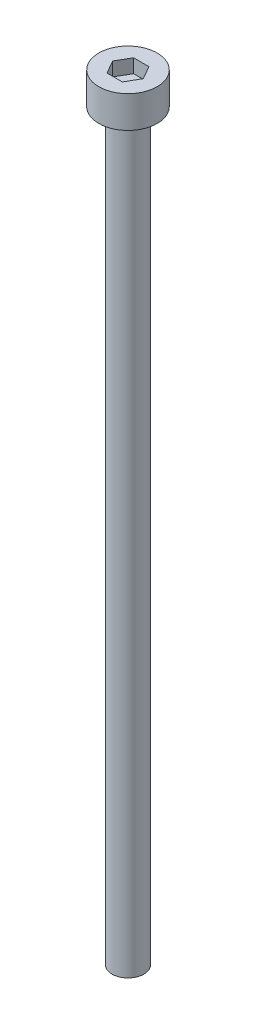
ISO-10303-21;
HEADER;
FILE_DESCRIPTION(('STEP AP214'),'2;1');
FILE_NAME('part.step','',(''),(''),'','','');
FILE_SCHEMA(('AUTOMOTIVE_DESIGN { 1 0 10303 214 1 1 1 1 }'));
ENDSEC;
DATA;
#1=APPLICATION_CONTEXT('core data for automotive mechanical design processes');
#2=APPLICATION_PROTOCOL_DEFINITION('international standard','automotive_design',2000,#1);
#3=PRODUCT_CONTEXT('',#1,'mechanical');
#4=PRODUCT('Part','Part','',(#3));
#5=PRODUCT_RELATED_PRODUCT_CATEGORY('part','',(#4));
#6=PRODUCT_DEFINITION_FORMATION('','',#4);
#7=PRODUCT_DEFINITION_CONTEXT('part definition',#1,'design');
#8=PRODUCT_DEFINITION('design','',#6,#7);
#9=PRODUCT_DEFINITION_SHAPE('','',#8);
#10=(LENGTH_UNIT() NAMED_UNIT(*) SI_UNIT(.MILLI.,.METRE.));
#11=(NAMED_UNIT(*) PLANE_ANGLE_UNIT() SI_UNIT($,.RADIAN.));
#12=(NAMED_UNIT(*) SI_UNIT($,.STERADIAN.) SOLID_ANGLE_UNIT());
#13=UNCERTAINTY_MEASURE_WITH_UNIT(LENGTH_MEASURE(1.E-05),#10,'distance_accuracy_value','');
#14=(GEOMETRIC_REPRESENTATION_CONTEXT(3) GLOBAL_UNCERTAINTY_ASSIGNED_CONTEXT((#13)) GLOBAL_UNIT_ASSIGNED_CONTEXT((#10,
#11,#12)) REPRESENTATION_CONTEXT('',''));
#15=CARTESIAN_POINT('',(0.,0.,0.));
#16=DIRECTION('',(0.,0.,1.));
#17=DIRECTION('',(1.,0.,0.));
#18=AXIS2_PLACEMENT_3D('',#15,#16,#17);
#19=CARTESIAN_POINT('',(0.,3.,0.));
#20=DIRECTION('',(0.,-1.,0.));
#21=DIRECTION('',(0.,0.,-1.));
#22=AXIS2_PLACEMENT_3D('',#19,#20,#21);
#23=CYLINDRICAL_SURFACE('',#22,2.75);
#24=CARTESIAN_POINT('',(0.,3.,0.));
#25=DIRECTION('',(0.,1.,0.));
#26=DIRECTION('',(0.,0.,1.));
#27=AXIS2_PLACEMENT_3D('',#24,#25,#26);
#28=CIRCLE('',#27,2.75);
#29=CARTESIAN_POINT('',(0.,3.,2.75));
#30=VERTEX_POINT('',#29);
#31=EDGE_CURVE('E45',#30,#30,#28,.T.);
#32=ORIENTED_EDGE('',*,*,#31,.F.);
#33=EDGE_LOOP('',(#32));
#34=FACE_BOUND('',#33,.T.);
#35=CARTESIAN_POINT('',(0.,0.,0.));
#36=DIRECTION('',(0.,1.,0.));
#37=DIRECTION('',(0.,0.,1.));
#38=AXIS2_PLACEMENT_3D('',#35,#36,#37);
#39=CIRCLE('',#38,2.75);
#40=CARTESIAN_POINT('',(0.,0.,2.75));
#41=VERTEX_POINT('',#40);
#42=EDGE_CURVE('E40',#41,#41,#39,.T.);
#43=ORIENTED_EDGE('',*,*,#42,.T.);
#44=EDGE_LOOP('',(#43));
#45=FACE_BOUND('',#44,.T.);
#46=ADVANCED_FACE('F37',(#34,#45),#23,.T.);
#47=CARTESIAN_POINT('',(0.,3.,0.));
#48=DIRECTION('',(0.,1.,0.));
#49=DIRECTION('',(0.,0.,1.));
#50=AXIS2_PLACEMENT_3D('',#47,#48,#49);
#51=PLANE('',#50);
#52=DIRECTION('',(0.5,0.,-0.866025403784439));
#53=VECTOR('',#52,1.);
#54=CARTESIAN_POINT('',(0.721687836487032,3.,1.25));
#55=LINE('',#54,#53);
#56=CARTESIAN_POINT('',(0.721687836487032,3.,1.25));
#57=VERTEX_POINT('',#56);
#58=CARTESIAN_POINT('',(1.44337567297406,3.,0.));
#59=VERTEX_POINT('',#58);
#60=EDGE_CURVE('E53',#57,#59,#55,.T.);
#61=ORIENTED_EDGE('',*,*,#60,.F.);
#62=DIRECTION('',(1.,0.,0.));
#63=VECTOR('',#62,1.);
#64=CARTESIAN_POINT('',(-0.721687836487033,3.,1.25));
#65=LINE('',#64,#63);
#66=CARTESIAN_POINT('',(-0.721687836487033,3.,1.25));
#67=VERTEX_POINT('',#66);
#68=EDGE_CURVE('E137',#67,#57,#65,.T.);
#69=ORIENTED_EDGE('',*,*,#68,.F.);
#70=DIRECTION('',(0.5,0.,0.866025403784439));
#71=VECTOR('',#70,1.);
#72=CARTESIAN_POINT('',(-1.44337567297407,3.,0.));
#73=LINE('',#72,#71);
#74=CARTESIAN_POINT('',(-1.44337567297407,3.,0.));
#75=VERTEX_POINT('',#74);
#76=EDGE_CURVE('E135',#75,#67,#73,.T.);
#77=ORIENTED_EDGE('',*,*,#76,.F.);
#78=DIRECTION('',(-0.5,0.,0.866025403784438));
#79=VECTOR('',#78,1.);
#80=CARTESIAN_POINT('',(-0.721687836487033,3.,-1.25));
#81=LINE('',#80,#79);
#82=CARTESIAN_POINT('',(-0.721687836487033,3.,-1.25));
#83=VERTEX_POINT('',#82);
#84=EDGE_CURVE('E101',#83,#75,#81,.T.);
#85=ORIENTED_EDGE('',*,*,#84,.F.);
#86=DIRECTION('',(-1.,0.,0.));
#87=VECTOR('',#86,1.);
#88=CARTESIAN_POINT('',(0.721687836487032,3.,-1.25));
#89=LINE('',#88,#87);
#90=CARTESIAN_POINT('',(0.721687836487032,3.,-1.25));
#91=VERTEX_POINT('',#90);
#92=EDGE_CURVE('E131',#91,#83,#89,.T.);
#93=ORIENTED_EDGE('',*,*,#92,.F.);
#94=DIRECTION('',(-0.5,0.,-0.866025403784439));
#95=VECTOR('',#94,1.);
#96=CARTESIAN_POINT('',(1.44337567297406,3.,0.));
#97=LINE('',#96,#95);
#98=EDGE_CURVE('E127',#59,#91,#97,.T.);
#99=ORIENTED_EDGE('',*,*,#98,.F.);
#100=EDGE_LOOP('',(#61,#69,#77,#85,#93,#99));
#101=FACE_BOUND('',#100,.T.);
#102=ORIENTED_EDGE('',*,*,#31,.T.);
#103=EDGE_LOOP('',(#102));
#104=FACE_BOUND('',#103,.T.);
#105=ADVANCED_FACE('F155',(#101,#104),#51,.T.);
#106=CARTESIAN_POINT('',(0.,0.,0.));
#107=DIRECTION('',(0.,1.,0.));
#108=DIRECTION('',(0.,0.,1.));
#109=AXIS2_PLACEMENT_3D('',#106,#107,#108);
#110=PLANE('',#109);
#111=CARTESIAN_POINT('',(0.,0.,0.));
#112=DIRECTION('',(0.,-1.,0.));
#113=DIRECTION('',(0.,0.,-1.));
#114=AXIS2_PLACEMENT_3D('',#111,#112,#113);
#115=CIRCLE('',#114,1.5);
#116=CARTESIAN_POINT('',(0.,0.,-1.5));
#117=VERTEX_POINT('',#116);
#118=EDGE_CURVE('E11',#117,#117,#115,.T.);
#119=ORIENTED_EDGE('',*,*,#118,.F.);
#120=EDGE_LOOP('',(#119));
#121=FACE_BOUND('',#120,.T.);
#122=ORIENTED_EDGE('',*,*,#42,.F.);
#123=EDGE_LOOP('',(#122));
#124=FACE_BOUND('',#123,.T.);
#125=ADVANCED_FACE('F152',(#121,#124),#110,.F.);
#126=CARTESIAN_POINT('',(0.721687836487032,1.7,1.25));
#127=DIRECTION('',(0.866025403784439,0.,0.5));
#128=DIRECTION('',(0.5,0.,-0.866025403784439));
#129=AXIS2_PLACEMENT_3D('',#126,#127,#128);
#130=PLANE('',#129);
#131=ORIENTED_EDGE('',*,*,#60,.T.);
#132=DIRECTION('',(0.,1.,0.));
#133=VECTOR('',#132,1.);
#134=CARTESIAN_POINT('',(1.44337567297406,1.7,0.));
#135=LINE('',#134,#133);
#136=CARTESIAN_POINT('',(1.44337567297406,1.7,0.));
#137=VERTEX_POINT('',#136);
#138=EDGE_CURVE('E83',#137,#59,#135,.T.);
#139=ORIENTED_EDGE('',*,*,#138,.F.);
#140=DIRECTION('',(0.5,0.,-0.866025403784439));
#141=VECTOR('',#140,1.);
#142=CARTESIAN_POINT('',(0.721687836487032,1.7,1.25));
#143=LINE('',#142,#141);
#144=CARTESIAN_POINT('',(0.721687836487032,1.7,1.25));
#145=VERTEX_POINT('',#144);
#146=EDGE_CURVE('E139',#145,#137,#143,.T.);
#147=ORIENTED_EDGE('',*,*,#146,.F.);
#148=DIRECTION('',(0.,1.,0.));
#149=VECTOR('',#148,1.);
#150=CARTESIAN_POINT('',(0.721687836487032,1.7,1.25));
#151=LINE('',#150,#149);
#152=EDGE_CURVE('E61',#145,#57,#151,.T.);
#153=ORIENTED_EDGE('',*,*,#152,.T.);
#154=EDGE_LOOP('',(#131,#139,#147,#153));
#155=FACE_BOUND('',#154,.T.);
#156=ADVANCED_FACE('F154',(#155),#130,.F.);
#157=CARTESIAN_POINT('',(-0.721687836487033,1.7,1.25));
#158=DIRECTION('',(0.,0.,1.));
#159=DIRECTION('',(1.,0.,0.));
#160=AXIS2_PLACEMENT_3D('',#157,#158,#159);
#161=PLANE('',#160);
#162=ORIENTED_EDGE('',*,*,#68,.T.);
#163=ORIENTED_EDGE('',*,*,#152,.F.);
#164=DIRECTION('',(1.,0.,0.));
#165=VECTOR('',#164,1.);
#166=CARTESIAN_POINT('',(-0.721687836487033,1.7,1.25));
#167=LINE('',#166,#165);
#168=CARTESIAN_POINT('',(-0.721687836487033,1.7,1.25));
#169=VERTEX_POINT('',#168);
#170=EDGE_CURVE('E113',#169,#145,#167,.T.);
#171=ORIENTED_EDGE('',*,*,#170,.F.);
#172=DIRECTION('',(0.,1.,0.));
#173=VECTOR('',#172,1.);
#174=CARTESIAN_POINT('',(-0.721687836487033,1.7,1.25));
#175=LINE('',#174,#173);
#176=EDGE_CURVE('E105',#169,#67,#175,.T.);
#177=ORIENTED_EDGE('',*,*,#176,.T.);
#178=EDGE_LOOP('',(#162,#163,#171,#177));
#179=FACE_BOUND('',#178,.T.);
#180=ADVANCED_FACE('F161',(#179),#161,.F.);
#181=CARTESIAN_POINT('',(-1.44337567297407,1.7,0.));
#182=DIRECTION('',(-0.866025403784439,0.,0.5));
#183=DIRECTION('',(0.5,0.,0.866025403784439));
#184=AXIS2_PLACEMENT_3D('',#181,#182,#183);
#185=PLANE('',#184);
#186=ORIENTED_EDGE('',*,*,#76,.T.);
#187=ORIENTED_EDGE('',*,*,#176,.F.);
#188=DIRECTION('',(0.5,0.,0.866025403784439));
#189=VECTOR('',#188,1.);
#190=CARTESIAN_POINT('',(-1.44337567297407,1.7,0.));
#191=LINE('',#190,#189);
#192=CARTESIAN_POINT('',(-1.44337567297407,1.7,0.));
#193=VERTEX_POINT('',#192);
#194=EDGE_CURVE('E109',#193,#169,#191,.T.);
#195=ORIENTED_EDGE('',*,*,#194,.F.);
#196=DIRECTION('',(0.,1.,0.));
#197=VECTOR('',#196,1.);
#198=CARTESIAN_POINT('',(-1.44337567297407,1.7,0.));
#199=LINE('',#198,#197);
#200=EDGE_CURVE('E94',#193,#75,#199,.T.);
#201=ORIENTED_EDGE('',*,*,#200,.T.);
#202=EDGE_LOOP('',(#186,#187,#195,#201));
#203=FACE_BOUND('',#202,.T.);
#204=ADVANCED_FACE('F110',(#203),#185,.F.);
#205=CARTESIAN_POINT('',(-0.721687836487033,1.7,-1.25));
#206=DIRECTION('',(-0.866025403784439,0.,-0.5));
#207=DIRECTION('',(-0.5,0.,0.866025403784439));
#208=AXIS2_PLACEMENT_3D('',#205,#206,#207);
#209=PLANE('',#208);
#210=ORIENTED_EDGE('',*,*,#84,.T.);
#211=ORIENTED_EDGE('',*,*,#200,.F.);
#212=DIRECTION('',(-0.5,0.,0.866025403784438));
#213=VECTOR('',#212,1.);
#214=CARTESIAN_POINT('',(-0.721687836487033,1.7,-1.25));
#215=LINE('',#214,#213);
#216=CARTESIAN_POINT('',(-0.721687836487033,1.7,-1.25));
#217=VERTEX_POINT('',#216);
#218=EDGE_CURVE('E98',#217,#193,#215,.T.);
#219=ORIENTED_EDGE('',*,*,#218,.F.);
#220=DIRECTION('',(0.,1.,0.));
#221=VECTOR('',#220,1.);
#222=CARTESIAN_POINT('',(-0.721687836487033,1.7,-1.25));
#223=LINE('',#222,#221);
#224=EDGE_CURVE('E106',#217,#83,#223,.T.);
#225=ORIENTED_EDGE('',*,*,#224,.T.);
#226=EDGE_LOOP('',(#210,#211,#219,#225));
#227=FACE_BOUND('',#226,.T.);
#228=ADVANCED_FACE('F96',(#227),#209,.F.);
#229=CARTESIAN_POINT('',(0.721687836487032,1.7,-1.25));
#230=DIRECTION('',(0.,0.,-1.));
#231=DIRECTION('',(-1.,0.,0.));
#232=AXIS2_PLACEMENT_3D('',#229,#230,#231);
#233=PLANE('',#232);
#234=ORIENTED_EDGE('',*,*,#92,.T.);
#235=ORIENTED_EDGE('',*,*,#224,.F.);
#236=DIRECTION('',(-1.,0.,0.));
#237=VECTOR('',#236,1.);
#238=CARTESIAN_POINT('',(0.721687836487032,1.7,-1.25));
#239=LINE('',#238,#237);
#240=CARTESIAN_POINT('',(0.721687836487032,1.7,-1.25));
#241=VERTEX_POINT('',#240);
#242=EDGE_CURVE('E119',#241,#217,#239,.T.);
#243=ORIENTED_EDGE('',*,*,#242,.F.);
#244=DIRECTION('',(0.,1.,0.));
#245=VECTOR('',#244,1.);
#246=CARTESIAN_POINT('',(0.721687836487032,1.7,-1.25));
#247=LINE('',#246,#245);
#248=EDGE_CURVE('E143',#241,#91,#247,.T.);
#249=ORIENTED_EDGE('',*,*,#248,.T.);
#250=EDGE_LOOP('',(#234,#235,#243,#249));
#251=FACE_BOUND('',#250,.T.);
#252=ADVANCED_FACE('F206',(#251),#233,.F.);
#253=CARTESIAN_POINT('',(1.44337567297406,1.7,0.));
#254=DIRECTION('',(0.866025403784439,0.,-0.5));
#255=DIRECTION('',(-0.5,0.,-0.866025403784439));
#256=AXIS2_PLACEMENT_3D('',#253,#254,#255);
#257=PLANE('',#256);
#258=ORIENTED_EDGE('',*,*,#98,.T.);
#259=ORIENTED_EDGE('',*,*,#248,.F.);
#260=DIRECTION('',(-0.5,0.,-0.866025403784439));
#261=VECTOR('',#260,1.);
#262=CARTESIAN_POINT('',(1.44337567297406,1.7,0.));
#263=LINE('',#262,#261);
#264=EDGE_CURVE('E121',#137,#241,#263,.T.);
#265=ORIENTED_EDGE('',*,*,#264,.F.);
#266=ORIENTED_EDGE('',*,*,#138,.T.);
#267=EDGE_LOOP('',(#258,#259,#265,#266));
#268=FACE_BOUND('',#267,.T.);
#269=ADVANCED_FACE('F215',(#268),#257,.F.);
#270=CARTESIAN_POINT('',(0.,1.7,0.));
#271=DIRECTION('',(0.,1.,0.));
#272=DIRECTION('',(0.,0.,1.));
#273=AXIS2_PLACEMENT_3D('',#270,#271,#272);
#274=PLANE('',#273);
#275=ORIENTED_EDGE('',*,*,#146,.T.);
#276=ORIENTED_EDGE('',*,*,#264,.T.);
#277=ORIENTED_EDGE('',*,*,#242,.T.);
#278=ORIENTED_EDGE('',*,*,#218,.T.);
#279=ORIENTED_EDGE('',*,*,#194,.T.);
#280=ORIENTED_EDGE('',*,*,#170,.T.);
#281=EDGE_LOOP('',(#275,#276,#277,#278,#279,#280));
#282=FACE_BOUND('',#281,.T.);
#283=ADVANCED_FACE('F116',(#282),#274,.T.);
#284=CARTESIAN_POINT('',(0.,-70.,0.));
#285=DIRECTION('',(0.,1.,0.));
#286=DIRECTION('',(0.,0.,1.));
#287=AXIS2_PLACEMENT_3D('',#284,#285,#286);
#288=CYLINDRICAL_SURFACE('',#287,1.5);
#289=CARTESIAN_POINT('',(0.,-70.,0.));
#290=DIRECTION('',(0.,-1.,0.));
#291=DIRECTION('',(0.,0.,-1.));
#292=AXIS2_PLACEMENT_3D('',#289,#290,#291);
#293=CIRCLE('',#292,1.5);
#294=CARTESIAN_POINT('',(0.,-70.,-1.5));
#295=VERTEX_POINT('',#294);
#296=EDGE_CURVE('E128',#295,#295,#293,.T.);
#297=ORIENTED_EDGE('',*,*,#296,.F.);
#298=EDGE_LOOP('',(#297));
#299=FACE_BOUND('',#298,.T.);
#300=ORIENTED_EDGE('',*,*,#118,.T.);
#301=EDGE_LOOP('',(#300));
#302=FACE_BOUND('',#301,.T.);
#303=ADVANCED_FACE('F233',(#299,#302),#288,.T.);
#304=CARTESIAN_POINT('',(0.,-70.,0.));
#305=DIRECTION('',(0.,-1.,0.));
#306=DIRECTION('',(0.,0.,-1.));
#307=AXIS2_PLACEMENT_3D('',#304,#305,#306);
#308=PLANE('',#307);
#309=ORIENTED_EDGE('',*,*,#296,.T.);
#310=EDGE_LOOP('',(#309));
#311=FACE_BOUND('',#310,.T.);
#312=ADVANCED_FACE('F247',(#311),#308,.T.);
#313=CLOSED_SHELL('',(#46,#105,#125,#156,#180,#204,#228,#252,#269,#283,#303,#312));
#314=MANIFOLD_SOLID_BREP('B2',#313);
#315=ADVANCED_BREP_SHAPE_REPRESENTATION('',(#18,#314),#14);
#316=SHAPE_DEFINITION_REPRESENTATION(#9,#315);
ENDSEC;
END-ISO-10303-21;
